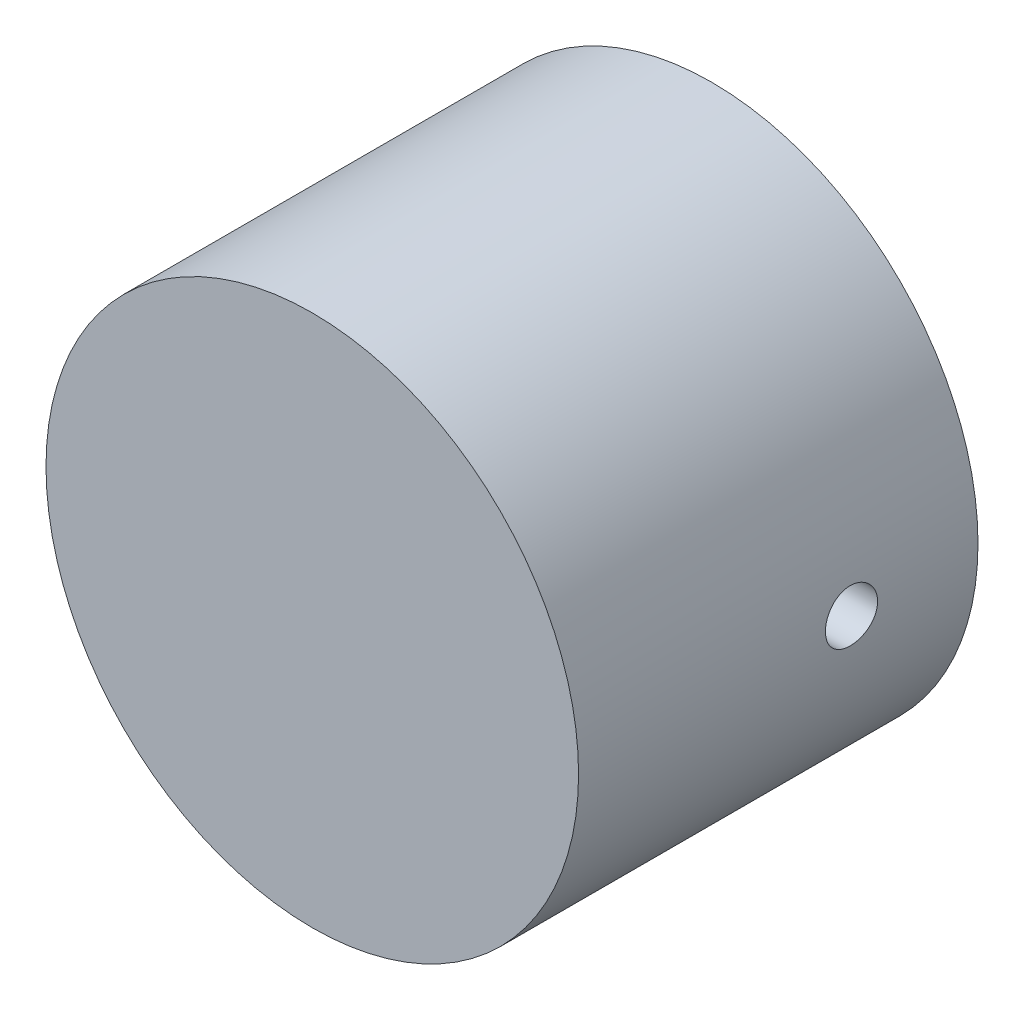
ISO-10303-21;
HEADER;
FILE_DESCRIPTION(('STEP AP214'),'2;1');
FILE_NAME('part.step','',(''),(''),'','','');
FILE_SCHEMA(('AUTOMOTIVE_DESIGN { 1 0 10303 214 1 1 1 1 }'));
ENDSEC;
DATA;
#1=APPLICATION_CONTEXT('core data for automotive mechanical design processes');
#2=APPLICATION_PROTOCOL_DEFINITION('international standard','automotive_design',2000,#1);
#3=PRODUCT_CONTEXT('',#1,'mechanical');
#4=PRODUCT('Part','Part','',(#3));
#5=PRODUCT_RELATED_PRODUCT_CATEGORY('part','',(#4));
#6=PRODUCT_DEFINITION_FORMATION('','',#4);
#7=PRODUCT_DEFINITION_CONTEXT('part definition',#1,'design');
#8=PRODUCT_DEFINITION('design','',#6,#7);
#9=PRODUCT_DEFINITION_SHAPE('','',#8);
#10=(LENGTH_UNIT() NAMED_UNIT(*) SI_UNIT(.MILLI.,.METRE.));
#11=(NAMED_UNIT(*) PLANE_ANGLE_UNIT() SI_UNIT($,.RADIAN.));
#12=(NAMED_UNIT(*) SI_UNIT($,.STERADIAN.) SOLID_ANGLE_UNIT());
#13=UNCERTAINTY_MEASURE_WITH_UNIT(LENGTH_MEASURE(1.E-05),#10,'distance_accuracy_value','');
#14=(GEOMETRIC_REPRESENTATION_CONTEXT(3) GLOBAL_UNCERTAINTY_ASSIGNED_CONTEXT((#13)) GLOBAL_UNIT_ASSIGNED_CONTEXT((#10,
#11,#12)) REPRESENTATION_CONTEXT('',''));
#15=CARTESIAN_POINT('',(0.,0.,0.));
#16=DIRECTION('',(0.,0.,1.));
#17=DIRECTION('',(1.,0.,0.));
#18=AXIS2_PLACEMENT_3D('',#15,#16,#17);
#19=CARTESIAN_POINT('',(0.,0.,-19.05));
#20=DIRECTION('',(0.,0.,1.));
#21=DIRECTION('',(1.,0.,0.));
#22=AXIS2_PLACEMENT_3D('',#19,#20,#21);
#23=CYLINDRICAL_SURFACE('',#22,9.525);
#24=CARTESIAN_POINT('',(9.525,0.,-14.2621));
#25=CARTESIAN_POINT('',(9.52499899376696,0.0695916638003268,-14.2620970601929));
#26=CARTESIAN_POINT('',(9.52422928110182,0.139226161079746,-14.2562434998505));
#27=CARTESIAN_POINT('',(9.52123279072317,0.276555629494705,-14.2329859429237));
#28=CARTESIAN_POINT('',(9.51900451327739,0.344248529369562,-14.2155700574083));
#29=CARTESIAN_POINT('',(9.51334179041614,0.475686941813274,-14.1697113018471));
#30=CARTESIAN_POINT('',(9.50990817824004,0.539435145604022,-14.1412760480047));
#31=CARTESIAN_POINT('',(9.50221614922092,0.661243227450895,-14.0742028178077));
#32=CARTESIAN_POINT('',(9.49795786816694,0.71930403961956,-14.0355665207651));
#33=CARTESIAN_POINT('',(9.48906299489322,0.828448810295295,-13.948940568395));
#34=CARTESIAN_POINT('',(9.48442449961535,0.879493758500664,-13.9009019522436));
#35=CARTESIAN_POINT('',(9.47530723310033,0.972821719092647,-13.796940196458));
#36=CARTESIAN_POINT('',(9.47082847022395,1.01510427339069,-13.7410166448644));
#37=CARTESIAN_POINT('',(9.46251911634794,1.0898539743324,-13.6226170438804));
#38=CARTESIAN_POINT('',(9.45869097942568,1.12228430647927,-13.5601175651582));
#39=CARTESIAN_POINT('',(9.4521416335894,1.17617384816128,-13.4305009525618));
#40=CARTESIAN_POINT('',(9.44942037887585,1.19763351163983,-13.3633840098789));
#41=CARTESIAN_POINT('',(9.44541121934885,1.22885342493013,-13.2268438241244));
#42=CARTESIAN_POINT('',(9.44411522118872,1.23867975946641,-13.1574359331504));
#43=CARTESIAN_POINT('',(9.44307859383045,1.24655862041931,-13.0179451025293));
#44=CARTESIAN_POINT('',(9.44333789647258,1.24461166279045,-12.9478621925986));
#45=CARTESIAN_POINT('',(9.44537516644071,1.22905340201366,-12.8094725909382));
#46=CARTESIAN_POINT('',(9.44714363385227,1.21551506272511,-12.7411575365638));
#47=CARTESIAN_POINT('',(9.45198515084481,1.17727226316354,-12.6077772674956));
#48=CARTESIAN_POINT('',(9.45505822909084,1.15256755754118,-12.5427121242443));
#49=CARTESIAN_POINT('',(9.46217342357477,1.09261541492865,-12.4174529559001));
#50=CARTESIAN_POINT('',(9.46621843127377,1.05733644081619,-12.3572741962072));
#51=CARTESIAN_POINT('',(9.47481951236272,0.977259740480976,-12.2436633856597));
#52=CARTESIAN_POINT('',(9.47937561127721,0.932461538755819,-12.1902316720448));
#53=CARTESIAN_POINT('',(9.48852769612259,0.834214484860672,-12.0912083092648));
#54=CARTESIAN_POINT('',(9.49312372313047,0.780702774528545,-12.0456790060861));
#55=CARTESIAN_POINT('',(9.50180562395982,0.666763667576891,-11.9642388871885));
#56=CARTESIAN_POINT('',(9.50589149641138,0.60633625238748,-11.928328097298));
#57=CARTESIAN_POINT('',(9.51309559696332,0.480231710960519,-11.8671436707991));
#58=CARTESIAN_POINT('',(9.51621345244018,0.414552575355872,-11.8418741290483));
#59=CARTESIAN_POINT('',(9.52112690839374,0.279833474933072,-11.8027399913867));
#60=CARTESIAN_POINT('',(9.52292257655071,0.210793682333465,-11.7888748117039));
#61=CARTESIAN_POINT('',(9.52498050315382,0.0718519177245126,-11.7730242271824));
#62=CARTESIAN_POINT('',(9.52525384230256,0.0019598970541478,-11.7709529744261));
#63=CARTESIAN_POINT('',(9.52426628233319,-0.137174619295246,-11.7785222079754));
#64=CARTESIAN_POINT('',(9.52300541899211,-0.20641713008266,-11.7881624211739));
#65=CARTESIAN_POINT('',(9.5190980152305,-0.342032355429299,-11.8188096008174));
#66=CARTESIAN_POINT('',(9.51645648894952,-0.408414519784086,-11.8397754452566));
#67=CARTESIAN_POINT('',(9.5100833731715,-0.536720854848642,-11.8924358619512));
#68=CARTESIAN_POINT('',(9.50635174356677,-0.598644861426811,-11.9241308289654));
#69=CARTESIAN_POINT('',(9.49818653724151,-0.716659246745357,-11.9975561571745));
#70=CARTESIAN_POINT('',(9.49374913973173,-0.77271494690714,-12.0393418239427));
#71=CARTESIAN_POINT('',(9.48468023359566,-0.877048225319135,-12.1316844327871));
#72=CARTESIAN_POINT('',(9.48004871652715,-0.925325464842624,-12.1822417566416));
#73=CARTESIAN_POINT('',(9.47107918081105,-1.01303764942598,-12.2910715713826));
#74=CARTESIAN_POINT('',(9.46674317355918,-1.0524155488393,-12.3493902287768));
#75=CARTESIAN_POINT('',(9.4588892277371,-1.12081665600217,-12.4718641537833));
#76=CARTESIAN_POINT('',(9.45537127150259,-1.14984008734464,-12.536019295326));
#77=CARTESIAN_POINT('',(9.44956564392585,-1.19661686004856,-12.6681639530298));
#78=CARTESIAN_POINT('',(9.44727451397199,-1.21440190993364,-12.7361420864791));
#79=CARTESIAN_POINT('',(9.44417218845417,-1.23829894822979,-12.8741519676939));
#80=CARTESIAN_POINT('',(9.44336091711561,-1.24441153431777,-12.9441836101251));
#81=CARTESIAN_POINT('',(9.4433125087689,-1.24477847665268,-13.0837448405495));
#82=CARTESIAN_POINT('',(9.44406347341831,-1.2391224651334,-13.1532742056802));
#83=CARTESIAN_POINT('',(9.44702928327325,-1.21630305124045,-13.2903847885206));
#84=CARTESIAN_POINT('',(9.44924412816889,-1.19913965130279,-13.3579660066425));
#85=CARTESIAN_POINT('',(9.45488435952931,-1.15382148820616,-13.4892473375859));
#86=CARTESIAN_POINT('',(9.45830922448267,-1.12567145967213,-13.5529491085809));
#87=CARTESIAN_POINT('',(9.46598440783224,-1.05918792362233,-13.6747394992478));
#88=CARTESIAN_POINT('',(9.47023474034486,-1.02085424195067,-13.7328280229015));
#89=CARTESIAN_POINT('',(9.47912069616025,-0.934760383588127,-13.8422006565471));
#90=CARTESIAN_POINT('',(9.48375890425771,-0.886933472709269,-13.8934320302159));
#91=CARTESIAN_POINT('',(9.49287543512057,-0.783350678833748,-13.9871755914363));
#92=CARTESIAN_POINT('',(9.49735372006256,-0.72759293545202,-14.029685727462));
#93=CARTESIAN_POINT('',(9.50566653305265,-0.609464017985763,-14.1049321997676));
#94=CARTESIAN_POINT('',(9.5094983127824,-0.547066362064877,-14.1376272485969));
#95=CARTESIAN_POINT('',(9.51605879000601,-0.417649641089422,-14.1920273420015));
#96=CARTESIAN_POINT('',(9.51878867369434,-0.350635637048566,-14.2137442110137));
#97=CARTESIAN_POINT('',(9.52218701647638,-0.236070165911652,-14.2404299807626));
#98=CARTESIAN_POINT('',(9.52323668810031,-0.189238177580591,-14.2485444054919));
#99=CARTESIAN_POINT('',(9.52464352024987,-0.0949441026959811,-14.2593803955438));
#100=CARTESIAN_POINT('',(9.52500068654744,-0.0474820213974888,-14.2621020058147));
#101=CARTESIAN_POINT('',(9.525,0.,-14.2621));
#102=B_SPLINE_CURVE_WITH_KNOTS('',3,(#24,#25,#26,#27,#28,#29,#30,#31,#32,#33,#34,#35,#36,#37,
#38,#39,#40,#41,#42,#43,#44,#45,#46,#47,#48,#49,#50,#51,#52,#53,#54,#55,#56,#57,#58,#59,#60,#61,
#62,#63,#64,#65,#66,#67,#68,#69,#70,#71,#72,#73,#74,#75,#76,#77,#78,#79,#80,#81,#82,#83,#84,#85,
#86,#87,#88,#89,#90,#91,#92,#93,#94,#95,#96,#97,#98,#99,#100,#101),.UNSPECIFIED.,.T.,.F.,(4,2,2,
2,2,2,2,2,2,2,2,2,2,2,2,2,2,2,2,2,2,2,2,2,2,2,2,2,2,2,2,2,2,2,2,2,2,2,4),(0.,0.208601540717983,
0.417417908326571,0.626090206011375,0.834728173126694,1.04448296539122,1.25424872064677,
1.46478892411098,1.67532041515466,1.88465012528203,2.09397066177948,2.30198320195953,
2.51000031284924,2.71864410216567,2.92729831606276,3.13753046934772,3.34776318715627,
3.55807673083078,3.7683795082057,3.97714951669609,4.18591465684109,4.3939268413056,
4.60194668003762,4.81113360718194,5.0203296412776,5.23083083556423,5.44132748404245,
5.65122754347253,5.86111685489043,6.0694134560209,6.27771001305703,6.48591690481895,
6.69412735746322,6.90385689112532,7.11363570374367,7.32428497519604,7.53470687337881,
7.67703577939105,7.81936349910673),.UNSPECIFIED.);
#103=CARTESIAN_POINT('',(9.525,0.,-14.2621));
#104=VERTEX_POINT('',#103);
#105=EDGE_CURVE('E40',#104,#104,#102,.T.);
#106=ORIENTED_EDGE('',*,*,#105,.T.);
#107=EDGE_LOOP('',(#106));
#108=FACE_BOUND('',#107,.T.);
#109=CARTESIAN_POINT('',(-9.525,0.,-14.2621));
#110=CARTESIAN_POINT('',(-9.52499899376696,-0.0695916638003268,-14.2620970601929));
#111=CARTESIAN_POINT('',(-9.52422928110182,-0.139226161079746,-14.2562434998505));
#112=CARTESIAN_POINT('',(-9.52123279072317,-0.276555629494705,-14.2329859429237));
#113=CARTESIAN_POINT('',(-9.51900451327739,-0.344248529369562,-14.2155700574083));
#114=CARTESIAN_POINT('',(-9.51334179041614,-0.475686941813274,-14.1697113018471));
#115=CARTESIAN_POINT('',(-9.50990817824004,-0.539435145604022,-14.1412760480047));
#116=CARTESIAN_POINT('',(-9.50221614922092,-0.661243227450895,-14.0742028178077));
#117=CARTESIAN_POINT('',(-9.49795786816693,-0.71930403961956,-14.0355665207651));
#118=CARTESIAN_POINT('',(-9.48906299489322,-0.828448810295296,-13.948940568395));
#119=CARTESIAN_POINT('',(-9.48442449961535,-0.879493758500665,-13.9009019522436));
#120=CARTESIAN_POINT('',(-9.47530723310033,-0.972821719092647,-13.796940196458));
#121=CARTESIAN_POINT('',(-9.47082847022395,-1.01510427339069,-13.7410166448644));
#122=CARTESIAN_POINT('',(-9.46251911634794,-1.0898539743324,-13.6226170438804));
#123=CARTESIAN_POINT('',(-9.45869097942568,-1.12228430647927,-13.5601175651582));
#124=CARTESIAN_POINT('',(-9.4521416335894,-1.17617384816128,-13.4305009525618));
#125=CARTESIAN_POINT('',(-9.44942037887585,-1.19763351163983,-13.3633840098789));
#126=CARTESIAN_POINT('',(-9.44541121934885,-1.22885342493013,-13.2268438241244));
#127=CARTESIAN_POINT('',(-9.44411522118872,-1.23867975946641,-13.1574359331504));
#128=CARTESIAN_POINT('',(-9.44307859383045,-1.24655862041931,-13.0179451025293));
#129=CARTESIAN_POINT('',(-9.44333789647258,-1.24461166279045,-12.9478621925986));
#130=CARTESIAN_POINT('',(-9.44537516644071,-1.22905340201366,-12.8094725909382));
#131=CARTESIAN_POINT('',(-9.44714363385226,-1.21551506272511,-12.7411575365638));
#132=CARTESIAN_POINT('',(-9.45198515084481,-1.17727226316354,-12.6077772674956));
#133=CARTESIAN_POINT('',(-9.45505822909084,-1.15256755754118,-12.5427121242443));
#134=CARTESIAN_POINT('',(-9.46217342357477,-1.09261541492865,-12.4174529559001));
#135=CARTESIAN_POINT('',(-9.46621843127377,-1.05733644081619,-12.3572741962072));
#136=CARTESIAN_POINT('',(-9.47481951236272,-0.977259740480975,-12.2436633856597));
#137=CARTESIAN_POINT('',(-9.47937561127721,-0.932461538755818,-12.1902316720448));
#138=CARTESIAN_POINT('',(-9.48852769612259,-0.834214484860672,-12.0912083092648));
#139=CARTESIAN_POINT('',(-9.49312372313047,-0.780702774528545,-12.0456790060861));
#140=CARTESIAN_POINT('',(-9.50180562395982,-0.666763667576891,-11.9642388871885));
#141=CARTESIAN_POINT('',(-9.50589149641138,-0.606336252387479,-11.928328097298));
#142=CARTESIAN_POINT('',(-9.51309559696332,-0.480231710960518,-11.8671436707991));
#143=CARTESIAN_POINT('',(-9.51621345244018,-0.414552575355872,-11.8418741290483));
#144=CARTESIAN_POINT('',(-9.52112690839374,-0.279833474933071,-11.8027399913867));
#145=CARTESIAN_POINT('',(-9.52292257655071,-0.210793682333465,-11.7888748117039));
#146=CARTESIAN_POINT('',(-9.52498050315382,-0.0718519177245123,-11.7730242271824));
#147=CARTESIAN_POINT('',(-9.52525384230256,-0.00195989705414762,-11.7709529744261));
#148=CARTESIAN_POINT('',(-9.52426628233319,0.137174619295246,-11.7785222079754));
#149=CARTESIAN_POINT('',(-9.52300541899211,0.20641713008266,-11.7881624211739));
#150=CARTESIAN_POINT('',(-9.5190980152305,0.342032355429299,-11.8188096008174));
#151=CARTESIAN_POINT('',(-9.51645648894952,0.408414519784086,-11.8397754452566));
#152=CARTESIAN_POINT('',(-9.5100833731715,0.536720854848642,-11.8924358619512));
#153=CARTESIAN_POINT('',(-9.50635174356677,0.598644861426811,-11.9241308289654));
#154=CARTESIAN_POINT('',(-9.49818653724151,0.716659246745357,-11.9975561571745));
#155=CARTESIAN_POINT('',(-9.49374913973173,0.77271494690714,-12.0393418239427));
#156=CARTESIAN_POINT('',(-9.48468023359566,0.877048225319135,-12.1316844327871));
#157=CARTESIAN_POINT('',(-9.48004871652715,0.925325464842624,-12.1822417566416));
#158=CARTESIAN_POINT('',(-9.47107918081105,1.01303764942598,-12.2910715713826));
#159=CARTESIAN_POINT('',(-9.46674317355918,1.0524155488393,-12.3493902287768));
#160=CARTESIAN_POINT('',(-9.4588892277371,1.12081665600217,-12.4718641537833));
#161=CARTESIAN_POINT('',(-9.45537127150259,1.14984008734464,-12.536019295326));
#162=CARTESIAN_POINT('',(-9.44956564392585,1.19661686004856,-12.6681639530298));
#163=CARTESIAN_POINT('',(-9.44727451397199,1.21440190993364,-12.7361420864791));
#164=CARTESIAN_POINT('',(-9.44417218845417,1.23829894822979,-12.8741519676939));
#165=CARTESIAN_POINT('',(-9.44336091711561,1.24441153431777,-12.9441836101251));
#166=CARTESIAN_POINT('',(-9.4433125087689,1.24477847665268,-13.0837448405495));
#167=CARTESIAN_POINT('',(-9.44406347341831,1.2391224651334,-13.1532742056802));
#168=CARTESIAN_POINT('',(-9.44702928327325,1.21630305124045,-13.2903847885206));
#169=CARTESIAN_POINT('',(-9.44924412816889,1.19913965130279,-13.3579660066425));
#170=CARTESIAN_POINT('',(-9.45488435952931,1.15382148820616,-13.4892473375859));
#171=CARTESIAN_POINT('',(-9.45830922448267,1.12567145967213,-13.5529491085809));
#172=CARTESIAN_POINT('',(-9.46598440783224,1.05918792362233,-13.6747394992478));
#173=CARTESIAN_POINT('',(-9.47023474034486,1.02085424195067,-13.7328280229015));
#174=CARTESIAN_POINT('',(-9.47912069616025,0.934760383588127,-13.8422006565471));
#175=CARTESIAN_POINT('',(-9.48375890425771,0.886933472709269,-13.8934320302159));
#176=CARTESIAN_POINT('',(-9.49287543512057,0.783350678833748,-13.9871755914363));
#177=CARTESIAN_POINT('',(-9.49735372006256,0.72759293545202,-14.029685727462));
#178=CARTESIAN_POINT('',(-9.50566653305265,0.609464017985763,-14.1049321997676));
#179=CARTESIAN_POINT('',(-9.5094983127824,0.547066362064878,-14.1376272485969));
#180=CARTESIAN_POINT('',(-9.51605879000601,0.417649641089423,-14.1920273420015));
#181=CARTESIAN_POINT('',(-9.51878867369434,0.350635637048566,-14.2137442110137));
#182=CARTESIAN_POINT('',(-9.52218701647638,0.236070165911652,-14.2404299807626));
#183=CARTESIAN_POINT('',(-9.52323668810031,0.189238177580591,-14.2485444054919));
#184=CARTESIAN_POINT('',(-9.52464352024987,0.0949441026959811,-14.2593803955438));
#185=CARTESIAN_POINT('',(-9.52500068654744,0.0474820213974888,-14.2621020058147));
#186=CARTESIAN_POINT('',(-9.525,0.,-14.2621));
#187=B_SPLINE_CURVE_WITH_KNOTS('',3,(#109,#110,#111,#112,#113,#114,#115,#116,#117,#118,#119,
#120,#121,#122,#123,#124,#125,#126,#127,#128,#129,#130,#131,#132,#133,#134,#135,#136,#137,#138,
#139,#140,#141,#142,#143,#144,#145,#146,#147,#148,#149,#150,#151,#152,#153,#154,#155,#156,#157,
#158,#159,#160,#161,#162,#163,#164,#165,#166,#167,#168,#169,#170,#171,#172,#173,#174,#175,#176,
#177,#178,#179,#180,#181,#182,#183,#184,#185,#186),.UNSPECIFIED.,.T.,.F.,(4,2,2,2,2,2,2,2,2,2,2,
2,2,2,2,2,2,2,2,2,2,2,2,2,2,2,2,2,2,2,2,2,2,2,2,2,2,2,4),(0.,0.208601540717983,
0.417417908326571,0.626090206011376,0.834728173126694,1.04448296539122,1.25424872064677,
1.46478892411098,1.67532041515466,1.88465012528203,2.09397066177948,2.30198320195953,
2.51000031284924,2.71864410216567,2.92729831606276,3.13753046934772,3.34776318715627,
3.55807673083078,3.7683795082057,3.97714951669609,4.18591465684109,4.3939268413056,
4.60194668003762,4.81113360718194,5.0203296412776,5.23083083556423,5.44132748404245,
5.65122754347253,5.86111685489043,6.0694134560209,6.27771001305703,6.48591690481895,
6.69412735746322,6.90385689112532,7.11363570374367,7.32428497519604,7.5347068733788,
7.67703577939105,7.81936349910673),.UNSPECIFIED.);
#188=CARTESIAN_POINT('',(-9.525,0.,-14.2621));
#189=VERTEX_POINT('',#188);
#190=EDGE_CURVE('E61',#189,#189,#187,.T.);
#191=ORIENTED_EDGE('',*,*,#190,.T.);
#192=EDGE_LOOP('',(#191));
#193=FACE_BOUND('',#192,.T.);
#194=CARTESIAN_POINT('',(0.,0.,-3.175));
#195=DIRECTION('',(0.,0.,1.));
#196=DIRECTION('',(1.,0.,0.));
#197=AXIS2_PLACEMENT_3D('',#194,#195,#196);
#198=CIRCLE('',#197,9.525);
#199=CARTESIAN_POINT('',(9.525,0.,-3.175));
#200=VERTEX_POINT('',#199);
#201=EDGE_CURVE('E99',#200,#200,#198,.T.);
#202=ORIENTED_EDGE('',*,*,#201,.T.);
#203=EDGE_LOOP('',(#202));
#204=FACE_BOUND('',#203,.T.);
#205=CARTESIAN_POINT('',(0.,0.,-15.4178));
#206=DIRECTION('',(0.,0.,-1.));
#207=DIRECTION('',(-1.,0.,0.));
#208=AXIS2_PLACEMENT_3D('',#205,#206,#207);
#209=CIRCLE('',#208,9.525);
#210=CARTESIAN_POINT('',(-9.525,0.,-15.4178));
#211=VERTEX_POINT('',#210);
#212=EDGE_CURVE('E137',#211,#211,#209,.T.);
#213=ORIENTED_EDGE('',*,*,#212,.T.);
#214=EDGE_LOOP('',(#213));
#215=FACE_BOUND('',#214,.T.);
#216=ADVANCED_FACE('F35',(#108,#193,#204,#215),#23,.F.);
#217=CARTESIAN_POINT('',(0.,0.,-19.05));
#218=DIRECTION('',(0.,0.,1.));
#219=DIRECTION('',(1.,0.,0.));
#220=AXIS2_PLACEMENT_3D('',#217,#218,#219);
#221=CYLINDRICAL_SURFACE('',#220,12.7);
#222=CARTESIAN_POINT('',(-12.7,0.,-14.2621));
#223=CARTESIAN_POINT('',(-12.6999992118775,-0.0697303020122867,-14.2620969768323));
#224=CARTESIAN_POINT('',(-12.6994196059281,-0.139506883351139,-14.2562201789768));
#225=CARTESIAN_POINT('',(-12.6971631762097,-0.277126072522789,-14.2328649127043));
#226=CARTESIAN_POINT('',(-12.6954851392076,-0.344966455229008,-14.2153736155964));
#227=CARTESIAN_POINT('',(-12.6912212943417,-0.476700422128338,-14.1693029976135));
#228=CARTESIAN_POINT('',(-12.6886360303452,-0.540596344032832,-14.1407303187638));
#229=CARTESIAN_POINT('',(-12.682846918591,-0.662671277813996,-14.0733207751815));
#230=CARTESIAN_POINT('',(-12.6796431950776,-0.72085143441189,-14.0344859714615));
#231=CARTESIAN_POINT('',(-12.6729637160054,-0.830058902227843,-13.9475101281549));
#232=CARTESIAN_POINT('',(-12.6694871535611,-0.88106364807091,-13.899340814659));
#233=CARTESIAN_POINT('',(-12.6626605116109,-0.974278550999365,-13.7951235460222));
#234=CARTESIAN_POINT('',(-12.659310437922,-1.01648830402211,-13.7390752290994));
#235=CARTESIAN_POINT('',(-12.6531077811571,-1.09099453812292,-13.6205502762126));
#236=CARTESIAN_POINT('',(-12.6502562243902,-1.12327067005917,-13.5580607902158));
#237=CARTESIAN_POINT('',(-12.6453833744956,-1.17686351932648,-13.4285165060838));
#238=CARTESIAN_POINT('',(-12.6433620616172,-1.19818049736915,-13.3614618165951));
#239=CARTESIAN_POINT('',(-12.6403857905373,-1.22918320315736,-13.2249202258657));
#240=CARTESIAN_POINT('',(-12.6394274089358,-1.23890627921643,-13.1554418806858));
#241=CARTESIAN_POINT('',(-12.6386748596695,-1.24656062005218,-13.0158333285473));
#242=CARTESIAN_POINT('',(-12.6388806625405,-1.24449218325736,-12.9457031381308));
#243=CARTESIAN_POINT('',(-12.6404301048789,-1.2286530078958,-12.80703889289));
#244=CARTESIAN_POINT('',(-12.6417697816285,-1.21492302408841,-12.7385001322796));
#245=CARTESIAN_POINT('',(-12.64542983043,-1.17621389945098,-12.6047044840328));
#246=CARTESIAN_POINT('',(-12.6477502152573,-1.15123461208068,-12.5394476391609));
#247=CARTESIAN_POINT('',(-12.6531147910418,-1.09069088173061,-12.4139393362898));
#248=CARTESIAN_POINT('',(-12.6561602183935,-1.05510833093243,-12.3536966682836));
#249=CARTESIAN_POINT('',(-12.6626306779936,-0.974381148951299,-12.240022966535));
#250=CARTESIAN_POINT('',(-12.6660557209087,-0.929236249049454,-12.1865921242845));
#251=CARTESIAN_POINT('',(-12.6729171493012,-0.830438117724241,-12.0878219367522));
#252=CARTESIAN_POINT('',(-12.6763535214325,-0.7767496848324,-12.0425177945103));
#253=CARTESIAN_POINT('',(-12.682836710536,-0.662510813140449,-11.9615597896956));
#254=CARTESIAN_POINT('',(-12.6858835270972,-0.601960367101509,-11.9259059373032));
#255=CARTESIAN_POINT('',(-12.6912452546113,-0.475692079257771,-11.865262107107));
#256=CARTESIAN_POINT('',(-12.6935600449764,-0.409973388303859,-11.840273886033));
#257=CARTESIAN_POINT('',(-12.6971956563466,-0.275245493918393,-11.8016962931197));
#258=CARTESIAN_POINT('',(-12.6985165058958,-0.206236385041385,-11.788106593937));
#259=CARTESIAN_POINT('',(-12.7000117447929,-0.06719146561197,-11.7727563982684));
#260=CARTESIAN_POINT('',(-12.7001908427011,0.00283893291063277,-11.7709473180887));
#261=CARTESIAN_POINT('',(-12.6993950179257,0.142206262335749,-11.7790821526417));
#262=CARTESIAN_POINT('',(-12.6984201102051,0.211543202218001,-11.7890259149853));
#263=CARTESIAN_POINT('',(-12.6954288556931,0.347415386450626,-11.8203438670276));
#264=CARTESIAN_POINT('',(-12.6934145790677,0.41395591671114,-11.8416953383727));
#265=CARTESIAN_POINT('',(-12.6885706006033,0.542510674534818,-11.895199289839));
#266=CARTESIAN_POINT('',(-12.6857408811698,0.604524804397516,-11.9273520030167));
#267=CARTESIAN_POINT('',(-12.6795708991914,0.7224862558398,-12.0016664356934));
#268=CARTESIAN_POINT('',(-12.6762290190811,0.778413360479164,-12.043860109678));
#269=CARTESIAN_POINT('',(-12.6694149920371,0.882408624170608,-12.1370128786762));
#270=CARTESIAN_POINT('',(-12.6659428419669,0.930476593848541,-12.1879721848462));
#271=CARTESIAN_POINT('',(-12.6592454708017,1.01755753945501,-12.2974215063956));
#272=CARTESIAN_POINT('',(-12.6560211443896,1.05653865326147,-12.3559369346195));
#273=CARTESIAN_POINT('',(-12.6501979750504,1.1241203949023,-12.4787119685481));
#274=CARTESIAN_POINT('',(-12.647599123864,1.15272115981277,-12.5429714983861));
#275=CARTESIAN_POINT('',(-12.643326665565,1.19867687163247,-12.6753009140475));
#276=CARTESIAN_POINT('',(-12.64165149359,1.21605084718545,-12.7433641389375));
#277=CARTESIAN_POINT('',(-12.6394111508632,1.2391215655445,-12.8814589921556));
#278=CARTESIAN_POINT('',(-12.6388459496491,1.24481862881635,-12.9514905664102));
#279=CARTESIAN_POINT('',(-12.6388901572597,1.24436945408861,-13.0912174977513));
#280=CARTESIAN_POINT('',(-12.6394946019183,1.23827326857305,-13.1609130227231));
#281=CARTESIAN_POINT('',(-12.6417994153479,1.21451551564151,-13.2982848320944));
#282=CARTESIAN_POINT('',(-12.6434997854153,1.19685393454406,-13.3659611141051));
#283=CARTESIAN_POINT('',(-12.6478034925059,1.15048040576535,-13.497373440787));
#284=CARTESIAN_POINT('',(-12.6504067153224,1.12176985567768,-13.5611099826164));
#285=CARTESIAN_POINT('',(-12.6562230385521,1.05411858538472,-13.6828673257106));
#286=CARTESIAN_POINT('',(-12.659436134758,1.01517793575284,-13.740888166402));
#287=CARTESIAN_POINT('',(-12.6661264925511,0.927983817209301,-13.8498236075054));
#288=CARTESIAN_POINT('',(-12.6696047765725,0.879693071052605,-13.9007083083032));
#289=CARTESIAN_POINT('',(-12.6764242512472,0.775242733802868,-13.9936744177002));
#290=CARTESIAN_POINT('',(-12.6797654088204,0.719081258260496,-14.0357537120319));
#291=CARTESIAN_POINT('',(-12.6859425507651,0.600335172368841,-14.1099942503077));
#292=CARTESIAN_POINT('',(-12.6887772870911,0.537735276637879,-14.1421311304444));
#293=CARTESIAN_POINT('',(-12.6936085059498,0.408040327631713,-14.1953946923304));
#294=CARTESIAN_POINT('',(-12.6956059355101,0.340950452885164,-14.2165338195428));
#295=CARTESIAN_POINT('',(-12.6980341823808,0.227898896669927,-14.2419161191703));
#296=CARTESIAN_POINT('',(-12.6987679370069,0.182660480748926,-14.2494747693659));
#297=CARTESIAN_POINT('',(-12.6997511038093,0.0916213695101973,-14.259567693208));
#298=CARTESIAN_POINT('',(-12.7000005178854,0.045820676398698,-14.2621019865623));
#299=CARTESIAN_POINT('',(-12.7,0.,-14.2621));
#300=B_SPLINE_CURVE_WITH_KNOTS('',3,(#222,#223,#224,#225,#226,#227,#228,#229,#230,#231,#232,
#233,#234,#235,#236,#237,#238,#239,#240,#241,#242,#243,#244,#245,#246,#247,#248,#249,#250,#251,
#252,#253,#254,#255,#256,#257,#258,#259,#260,#261,#262,#263,#264,#265,#266,#267,#268,#269,#270,
#271,#272,#273,#274,#275,#276,#277,#278,#279,#280,#281,#282,#283,#284,#285,#286,#287,#288,#289,
#290,#291,#292,#293,#294,#295,#296,#297,#298,#299),.UNSPECIFIED.,.T.,.F.,(4,2,2,2,2,2,2,2,2,2,2,
2,2,2,2,2,2,2,2,2,2,2,2,2,2,2,2,2,2,2,2,2,2,2,2,2,2,2,4),(0.,0.209023589231034,
0.418278438489406,0.627408056675216,0.836495705811906,1.04622686307429,1.25596765375546,
1.46613528427644,1.6762979148057,1.88578168761911,2.0952601586828,2.30400954276648,
2.51276164622489,2.72187231119901,2.93098885333196,3.14099044735331,3.35099226291022,
3.56102865440525,3.77105901385791,3.98022264907491,4.1893835722733,4.39812949750455,
4.60687992709801,4.81630378657599,5.02573269159929,5.23588524778483,5.4460350287325,
5.65582767928566,5.8656145721293,6.07451304805127,6.28341177109341,6.49228407903672,
6.70115494609034,6.91087636148271,7.1206480754811,7.33092983462728,7.54097311071026,
7.67832573264912,7.81567781582469),.UNSPECIFIED.);
#301=CARTESIAN_POINT('',(-12.7,0.,-14.2621));
#302=VERTEX_POINT('',#301);
#303=EDGE_CURVE('E91',#302,#302,#300,.T.);
#304=ORIENTED_EDGE('',*,*,#303,.F.);
#305=EDGE_LOOP('',(#304));
#306=FACE_BOUND('',#305,.T.);
#307=CARTESIAN_POINT('',(12.7,0.,-14.2621));
#308=CARTESIAN_POINT('',(12.6999992118775,0.0697303020122868,-14.2620969768323));
#309=CARTESIAN_POINT('',(12.6994196059281,0.139506883351139,-14.2562201789768));
#310=CARTESIAN_POINT('',(12.6971631762097,0.277126072522789,-14.2328649127043));
#311=CARTESIAN_POINT('',(12.6954851392076,0.344966455229008,-14.2153736155964));
#312=CARTESIAN_POINT('',(12.6912212943417,0.476700422128338,-14.1693029976135));
#313=CARTESIAN_POINT('',(12.6886360303452,0.540596344032832,-14.1407303187638));
#314=CARTESIAN_POINT('',(12.682846918591,0.662671277813997,-14.0733207751815));
#315=CARTESIAN_POINT('',(12.6796431950776,0.720851434411891,-14.0344859714615));
#316=CARTESIAN_POINT('',(12.6729637160054,0.830058902227843,-13.9475101281549));
#317=CARTESIAN_POINT('',(12.6694871535611,0.88106364807091,-13.899340814659));
#318=CARTESIAN_POINT('',(12.6626605116109,0.974278550999365,-13.7951235460222));
#319=CARTESIAN_POINT('',(12.659310437922,1.01648830402211,-13.7390752290994));
#320=CARTESIAN_POINT('',(12.6531077811571,1.09099453812292,-13.6205502762126));
#321=CARTESIAN_POINT('',(12.6502562243902,1.12327067005917,-13.5580607902158));
#322=CARTESIAN_POINT('',(12.6453833744956,1.17686351932648,-13.4285165060838));
#323=CARTESIAN_POINT('',(12.6433620616172,1.19818049736915,-13.3614618165951));
#324=CARTESIAN_POINT('',(12.6403857905373,1.22918320315736,-13.2249202258657));
#325=CARTESIAN_POINT('',(12.6394274089358,1.23890627921643,-13.1554418806858));
#326=CARTESIAN_POINT('',(12.6386748596695,1.24656062005218,-13.0158333285473));
#327=CARTESIAN_POINT('',(12.6388806625405,1.24449218325736,-12.9457031381308));
#328=CARTESIAN_POINT('',(12.6404301048789,1.2286530078958,-12.80703889289));
#329=CARTESIAN_POINT('',(12.6417697816285,1.21492302408841,-12.7385001322796));
#330=CARTESIAN_POINT('',(12.64542983043,1.17621389945098,-12.6047044840328));
#331=CARTESIAN_POINT('',(12.6477502152573,1.15123461208068,-12.5394476391609));
#332=CARTESIAN_POINT('',(12.6531147910418,1.09069088173061,-12.4139393362898));
#333=CARTESIAN_POINT('',(12.6561602183935,1.05510833093243,-12.3536966682836));
#334=CARTESIAN_POINT('',(12.6626306779936,0.974381148951299,-12.240022966535));
#335=CARTESIAN_POINT('',(12.6660557209087,0.929236249049454,-12.1865921242845));
#336=CARTESIAN_POINT('',(12.6729171493012,0.830438117724241,-12.0878219367522));
#337=CARTESIAN_POINT('',(12.6763535214325,0.7767496848324,-12.0425177945103));
#338=CARTESIAN_POINT('',(12.682836710536,0.662510813140448,-11.9615597896956));
#339=CARTESIAN_POINT('',(12.6858835270972,0.601960367101509,-11.9259059373032));
#340=CARTESIAN_POINT('',(12.6912452546113,0.47569207925777,-11.865262107107));
#341=CARTESIAN_POINT('',(12.6935600449764,0.409973388303858,-11.840273886033));
#342=CARTESIAN_POINT('',(12.6971956563466,0.275245493918392,-11.8016962931197));
#343=CARTESIAN_POINT('',(12.6985165058958,0.206236385041384,-11.788106593937));
#344=CARTESIAN_POINT('',(12.7000117447929,0.0671914656119696,-11.7727563982684));
#345=CARTESIAN_POINT('',(12.7001908427011,-0.00283893291063317,-11.7709473180887));
#346=CARTESIAN_POINT('',(12.6993950179257,-0.14220626233575,-11.7790821526417));
#347=CARTESIAN_POINT('',(12.6984201102051,-0.211543202218001,-11.7890259149853));
#348=CARTESIAN_POINT('',(12.6954288556931,-0.347415386450626,-11.8203438670276));
#349=CARTESIAN_POINT('',(12.6934145790677,-0.413955916711141,-11.8416953383727));
#350=CARTESIAN_POINT('',(12.6885706006033,-0.542510674534819,-11.895199289839));
#351=CARTESIAN_POINT('',(12.6857408811698,-0.604524804397516,-11.9273520030167));
#352=CARTESIAN_POINT('',(12.6795708991914,-0.7224862558398,-12.0016664356934));
#353=CARTESIAN_POINT('',(12.6762290190811,-0.778413360479164,-12.043860109678));
#354=CARTESIAN_POINT('',(12.6694149920371,-0.882408624170608,-12.1370128786762));
#355=CARTESIAN_POINT('',(12.6659428419669,-0.930476593848541,-12.1879721848462));
#356=CARTESIAN_POINT('',(12.6592454708017,-1.01755753945501,-12.2974215063956));
#357=CARTESIAN_POINT('',(12.6560211443896,-1.05653865326147,-12.3559369346195));
#358=CARTESIAN_POINT('',(12.6501979750504,-1.1241203949023,-12.4787119685481));
#359=CARTESIAN_POINT('',(12.647599123864,-1.15272115981277,-12.5429714983861));
#360=CARTESIAN_POINT('',(12.643326665565,-1.19867687163247,-12.6753009140475));
#361=CARTESIAN_POINT('',(12.64165149359,-1.21605084718545,-12.7433641389375));
#362=CARTESIAN_POINT('',(12.6394111508632,-1.2391215655445,-12.8814589921556));
#363=CARTESIAN_POINT('',(12.6388459496491,-1.24481862881635,-12.9514905664102));
#364=CARTESIAN_POINT('',(12.6388901572597,-1.24436945408861,-13.0912174977513));
#365=CARTESIAN_POINT('',(12.6394946019183,-1.23827326857305,-13.1609130227231));
#366=CARTESIAN_POINT('',(12.6417994153479,-1.21451551564151,-13.2982848320944));
#367=CARTESIAN_POINT('',(12.6434997854153,-1.19685393454406,-13.3659611141051));
#368=CARTESIAN_POINT('',(12.6478034925059,-1.15048040576535,-13.497373440787));
#369=CARTESIAN_POINT('',(12.6504067153224,-1.12176985567768,-13.5611099826164));
#370=CARTESIAN_POINT('',(12.6562230385521,-1.05411858538472,-13.6828673257106));
#371=CARTESIAN_POINT('',(12.659436134758,-1.01517793575284,-13.740888166402));
#372=CARTESIAN_POINT('',(12.6661264925511,-0.927983817209301,-13.8498236075054));
#373=CARTESIAN_POINT('',(12.6696047765725,-0.879693071052605,-13.9007083083032));
#374=CARTESIAN_POINT('',(12.6764242512472,-0.775242733802869,-13.9936744177002));
#375=CARTESIAN_POINT('',(12.6797654088204,-0.719081258260496,-14.0357537120319));
#376=CARTESIAN_POINT('',(12.6859425507651,-0.600335172368841,-14.1099942503077));
#377=CARTESIAN_POINT('',(12.6887772870911,-0.537735276637879,-14.1421311304444));
#378=CARTESIAN_POINT('',(12.6936085059498,-0.408040327631713,-14.1953946923304));
#379=CARTESIAN_POINT('',(12.6956059355101,-0.340950452885164,-14.2165338195428));
#380=CARTESIAN_POINT('',(12.6980341823808,-0.227898896669927,-14.2419161191703));
#381=CARTESIAN_POINT('',(12.6987679370069,-0.182660480748925,-14.2494747693659));
#382=CARTESIAN_POINT('',(12.6997511038093,-0.0916213695101968,-14.259567693208));
#383=CARTESIAN_POINT('',(12.7000005178854,-0.0458206763986977,-14.2621019865623));
#384=CARTESIAN_POINT('',(12.7,0.,-14.2621));
#385=B_SPLINE_CURVE_WITH_KNOTS('',3,(#307,#308,#309,#310,#311,#312,#313,#314,#315,#316,#317,
#318,#319,#320,#321,#322,#323,#324,#325,#326,#327,#328,#329,#330,#331,#332,#333,#334,#335,#336,
#337,#338,#339,#340,#341,#342,#343,#344,#345,#346,#347,#348,#349,#350,#351,#352,#353,#354,#355,
#356,#357,#358,#359,#360,#361,#362,#363,#364,#365,#366,#367,#368,#369,#370,#371,#372,#373,#374,
#375,#376,#377,#378,#379,#380,#381,#382,#383,#384),.UNSPECIFIED.,.T.,.F.,(4,2,2,2,2,2,2,2,2,2,2,
2,2,2,2,2,2,2,2,2,2,2,2,2,2,2,2,2,2,2,2,2,2,2,2,2,2,2,4),(0.,0.209023589231034,
0.418278438489406,0.627408056675217,0.836495705811907,1.04622686307429,1.25596765375546,
1.46613528427644,1.6762979148057,1.88578168761911,2.0952601586828,2.30400954276648,
2.51276164622489,2.72187231119901,2.93098885333196,3.14099044735331,3.35099226291022,
3.56102865440525,3.77105901385791,3.98022264907491,4.1893835722733,4.39812949750455,
4.60687992709801,4.81630378657599,5.02573269159929,5.23588524778483,5.4460350287325,
5.65582767928566,5.8656145721293,6.07451304805127,6.28341177109341,6.49228407903672,
6.70115494609034,6.91087636148271,7.1206480754811,7.33092983462728,7.54097311071026,
7.67832573264912,7.81567781582469),.UNSPECIFIED.);
#386=CARTESIAN_POINT('',(12.7,0.,-14.2621));
#387=VERTEX_POINT('',#386);
#388=EDGE_CURVE('E84',#387,#387,#385,.T.);
#389=ORIENTED_EDGE('',*,*,#388,.F.);
#390=EDGE_LOOP('',(#389));
#391=FACE_BOUND('',#390,.T.);
#392=CARTESIAN_POINT('',(0.,0.,-19.05));
#393=DIRECTION('',(0.,0.,1.));
#394=DIRECTION('',(1.,0.,0.));
#395=AXIS2_PLACEMENT_3D('',#392,#393,#394);
#396=CIRCLE('',#395,12.7);
#397=CARTESIAN_POINT('',(12.7,0.,-19.05));
#398=VERTEX_POINT('',#397);
#399=EDGE_CURVE('E10',#398,#398,#396,.T.);
#400=ORIENTED_EDGE('',*,*,#399,.T.);
#401=EDGE_LOOP('',(#400));
#402=FACE_BOUND('',#401,.T.);
#403=CARTESIAN_POINT('',(0.,0.,0.));
#404=DIRECTION('',(0.,0.,1.));
#405=DIRECTION('',(1.,0.,0.));
#406=AXIS2_PLACEMENT_3D('',#403,#404,#405);
#407=CIRCLE('',#406,12.7);
#408=CARTESIAN_POINT('',(12.7,0.,0.));
#409=VERTEX_POINT('',#408);
#410=EDGE_CURVE('E50',#409,#409,#407,.T.);
#411=ORIENTED_EDGE('',*,*,#410,.F.);
#412=EDGE_LOOP('',(#411));
#413=FACE_BOUND('',#412,.T.);
#414=ADVANCED_FACE('F37',(#306,#391,#402,#413),#221,.T.);
#415=CARTESIAN_POINT('',(0.,0.,-19.05));
#416=DIRECTION('',(0.,0.,1.));
#417=DIRECTION('',(1.,0.,0.));
#418=AXIS2_PLACEMENT_3D('',#415,#416,#417);
#419=PLANE('',#418);
#420=CARTESIAN_POINT('',(0.,0.,-19.05));
#421=DIRECTION('',(0.,0.,1.));
#422=DIRECTION('',(1.,0.,0.));
#423=AXIS2_PLACEMENT_3D('',#420,#421,#422);
#424=CIRCLE('',#423,9.525);
#425=CARTESIAN_POINT('',(9.525,0.,-19.05));
#426=VERTEX_POINT('',#425);
#427=EDGE_CURVE('E57',#426,#426,#424,.T.);
#428=ORIENTED_EDGE('',*,*,#427,.T.);
#429=EDGE_LOOP('',(#428));
#430=FACE_BOUND('',#429,.T.);
#431=ORIENTED_EDGE('',*,*,#399,.F.);
#432=EDGE_LOOP('',(#431));
#433=FACE_BOUND('',#432,.T.);
#434=ADVANCED_FACE('F110',(#430,#433),#419,.F.);
#435=CARTESIAN_POINT('',(0.,0.,0.));
#436=DIRECTION('',(0.,0.,1.));
#437=DIRECTION('',(1.,0.,0.));
#438=AXIS2_PLACEMENT_3D('',#435,#436,#437);
#439=PLANE('',#438);
#440=ORIENTED_EDGE('',*,*,#410,.T.);
#441=EDGE_LOOP('',(#440));
#442=FACE_BOUND('',#441,.T.);
#443=ADVANCED_FACE('F115',(#442),#439,.T.);
#444=CARTESIAN_POINT('',(0.,0.,-17.78));
#445=DIRECTION('',(0.,0.,-1.));
#446=DIRECTION('',(-1.,0.,0.));
#447=AXIS2_PLACEMENT_3D('',#444,#445,#446);
#448=CIRCLE('',#447,9.525);
#449=CARTESIAN_POINT('',(9.525,0.,-17.78));
#450=VERTEX_POINT('',#449);
#451=EDGE_CURVE('E140',#450,#450,#448,.T.);
#452=CARTESIAN_POINT('',(9.525,0.,-17.78));
#453=CARTESIAN_POINT('',(9.525,0.,-17.7932291666667));
#454=CARTESIAN_POINT('',(9.525,0.,-17.8064583333333));
#455=CARTESIAN_POINT('',(9.525,0.,-17.8329166666667));
#456=CARTESIAN_POINT('',(9.525,0.,-17.8461458333333));
#457=CARTESIAN_POINT('',(9.525,0.,-17.8726041666667));
#458=CARTESIAN_POINT('',(9.525,0.,-17.8858333333333));
#459=CARTESIAN_POINT('',(9.525,0.,-17.9122916666667));
#460=CARTESIAN_POINT('',(9.525,0.,-17.9255208333333));
#461=CARTESIAN_POINT('',(9.525,0.,-17.9519791666667));
#462=CARTESIAN_POINT('',(9.525,0.,-17.9652083333333));
#463=CARTESIAN_POINT('',(9.525,0.,-17.9916666666667));
#464=CARTESIAN_POINT('',(9.525,0.,-18.0048958333333));
#465=CARTESIAN_POINT('',(9.525,0.,-18.0313541666667));
#466=CARTESIAN_POINT('',(9.525,0.,-18.0445833333333));
#467=CARTESIAN_POINT('',(9.525,0.,-18.0710416666667));
#468=CARTESIAN_POINT('',(9.525,0.,-18.0842708333333));
#469=CARTESIAN_POINT('',(9.525,0.,-18.1107291666667));
#470=CARTESIAN_POINT('',(9.525,0.,-18.1239583333333));
#471=CARTESIAN_POINT('',(9.525,0.,-18.1504166666667));
#472=CARTESIAN_POINT('',(9.525,0.,-18.1636458333333));
#473=CARTESIAN_POINT('',(9.525,0.,-18.1901041666667));
#474=CARTESIAN_POINT('',(9.525,0.,-18.2033333333333));
#475=CARTESIAN_POINT('',(9.525,0.,-18.2297916666667));
#476=CARTESIAN_POINT('',(9.525,0.,-18.2430208333333));
#477=CARTESIAN_POINT('',(9.525,0.,-18.2694791666667));
#478=CARTESIAN_POINT('',(9.525,0.,-18.2827083333333));
#479=CARTESIAN_POINT('',(9.525,0.,-18.3091666666667));
#480=CARTESIAN_POINT('',(9.525,0.,-18.3223958333333));
#481=CARTESIAN_POINT('',(9.525,0.,-18.3488541666667));
#482=CARTESIAN_POINT('',(9.525,0.,-18.3620833333333));
#483=CARTESIAN_POINT('',(9.525,0.,-18.3885416666667));
#484=CARTESIAN_POINT('',(9.525,0.,-18.4017708333333));
#485=CARTESIAN_POINT('',(9.525,0.,-18.4282291666667));
#486=CARTESIAN_POINT('',(9.525,0.,-18.4414583333333));
#487=CARTESIAN_POINT('',(9.525,0.,-18.4679166666667));
#488=CARTESIAN_POINT('',(9.525,0.,-18.4811458333333));
#489=CARTESIAN_POINT('',(9.525,0.,-18.5076041666667));
#490=CARTESIAN_POINT('',(9.525,0.,-18.5208333333333));
#491=CARTESIAN_POINT('',(9.525,0.,-18.5472916666667));
#492=CARTESIAN_POINT('',(9.525,0.,-18.5605208333333));
#493=CARTESIAN_POINT('',(9.525,0.,-18.5869791666667));
#494=CARTESIAN_POINT('',(9.525,0.,-18.6002083333333));
#495=CARTESIAN_POINT('',(9.525,0.,-18.6266666666667));
#496=CARTESIAN_POINT('',(9.525,0.,-18.6398958333333));
#497=CARTESIAN_POINT('',(9.525,0.,-18.6663541666667));
#498=CARTESIAN_POINT('',(9.525,0.,-18.6795833333333));
#499=CARTESIAN_POINT('',(9.525,0.,-18.7060416666667));
#500=CARTESIAN_POINT('',(9.525,0.,-18.7192708333333));
#501=CARTESIAN_POINT('',(9.525,0.,-18.7457291666667));
#502=CARTESIAN_POINT('',(9.525,0.,-18.7589583333333));
#503=CARTESIAN_POINT('',(9.525,0.,-18.7854166666667));
#504=CARTESIAN_POINT('',(9.525,0.,-18.7986458333333));
#505=CARTESIAN_POINT('',(9.525,0.,-18.8251041666667));
#506=CARTESIAN_POINT('',(9.525,0.,-18.8383333333333));
#507=CARTESIAN_POINT('',(9.525,0.,-18.8647916666667));
#508=CARTESIAN_POINT('',(9.525,0.,-18.8780208333333));
#509=CARTESIAN_POINT('',(9.525,0.,-18.9044791666667));
#510=CARTESIAN_POINT('',(9.525,0.,-18.9177083333333));
#511=CARTESIAN_POINT('',(9.525,0.,-18.9441666666667));
#512=CARTESIAN_POINT('',(9.525,0.,-18.9573958333333));
#513=CARTESIAN_POINT('',(9.525,0.,-18.9838541666667));
#514=CARTESIAN_POINT('',(9.525,0.,-18.9970833333333));
#515=CARTESIAN_POINT('',(9.525,0.,-19.0235416666667));
#516=CARTESIAN_POINT('',(9.525,0.,-19.0367708333333));
#517=CARTESIAN_POINT('',(9.525,0.,-19.05));
#518=B_SPLINE_CURVE_WITH_KNOTS('',3,(#452,#453,#454,#455,#456,#457,#458,#459,#460,#461,#462,
#463,#464,#465,#466,#467,#468,#469,#470,#471,#472,#473,#474,#475,#476,#477,#478,#479,#480,#481,
#482,#483,#484,#485,#486,#487,#488,#489,#490,#491,#492,#493,#494,#495,#496,#497,#498,#499,#500,
#501,#502,#503,#504,#505,#506,#507,#508,#509,#510,#511,#512,#513,#514,#515,#516,#517),
.UNSPECIFIED.,.F.,.F.,(4,2,2,2,2,2,2,2,2,2,2,2,2,2,2,2,2,2,2,2,2,2,2,2,2,2,2,2,2,2,2,2,4),(0.,
0.0396874999999998,0.0793749999999996,0.119062499999999,0.158749999999999,0.198437499999999,
0.238124999999999,0.277812499999999,0.317499999999998,0.357187499999998,0.396874999999998,
0.436562500000001,0.476250000000001,0.515937500000001,0.555625000000001,0.5953125,0.635,
0.6746875,0.714375,0.7540625,0.793749999999999,0.833437499999999,0.873125000000002,
0.912812500000002,0.952500000000002,0.992187500000002,1.031875,1.0715625,1.11125,1.1509375,
1.190625,1.2303125,1.27),.UNSPECIFIED.);
#519=EDGE_CURVE('BSEAM68',#450,#426,#518,.T.);
#520=ORIENTED_EDGE('',*,*,#451,.F.);
#521=ORIENTED_EDGE('',*,*,#427,.F.);
#522=ORIENTED_EDGE('',*,*,#519,.T.);
#523=ORIENTED_EDGE('',*,*,#519,.F.);
#524=EDGE_LOOP('',(#520,#522,#521,#523));
#525=FACE_BOUND('',#524,.T.);
#526=ADVANCED_FACE('F68',(#525),#23,.F.);
#527=CARTESIAN_POINT('',(0.,0.,-3.175));
#528=DIRECTION('',(0.,0.,1.));
#529=DIRECTION('',(1.,0.,0.));
#530=AXIS2_PLACEMENT_3D('',#527,#528,#529);
#531=PLANE('',#530);
#532=ORIENTED_EDGE('',*,*,#201,.F.);
#533=EDGE_LOOP('',(#532));
#534=FACE_BOUND('',#533,.T.);
#535=ADVANCED_FACE('F114',(#534),#531,.F.);
#536=CARTESIAN_POINT('',(-12.7,0.,-13.0175));
#537=DIRECTION('',(1.,0.,0.));
#538=DIRECTION('',(0.,0.,-1.));
#539=AXIS2_PLACEMENT_3D('',#536,#537,#538);
#540=CYLINDRICAL_SURFACE('',#539,1.2446);
#541=ORIENTED_EDGE('',*,*,#303,.T.);
#542=EDGE_LOOP('',(#541));
#543=FACE_BOUND('',#542,.T.);
#544=ORIENTED_EDGE('',*,*,#190,.F.);
#545=EDGE_LOOP('',(#544));
#546=FACE_BOUND('',#545,.T.);
#547=ADVANCED_FACE('F76',(#543,#546),#540,.F.);
#548=ORIENTED_EDGE('',*,*,#388,.T.);
#549=EDGE_LOOP('',(#548));
#550=FACE_BOUND('',#549,.T.);
#551=ORIENTED_EDGE('',*,*,#105,.F.);
#552=EDGE_LOOP('',(#551));
#553=FACE_BOUND('',#552,.T.);
#554=ADVANCED_FACE('F71',(#550,#553),#540,.F.);
#555=CARTESIAN_POINT('',(0.,0.,-15.4178));
#556=DIRECTION('',(0.,0.,-1.));
#557=DIRECTION('',(-1.,0.,0.));
#558=AXIS2_PLACEMENT_3D('',#555,#556,#557);
#559=CYLINDRICAL_SURFACE('',#558,10.8712);
#560=CARTESIAN_POINT('',(0.,0.,-15.4178));
#561=DIRECTION('',(0.,0.,-1.));
#562=DIRECTION('',(-1.,0.,0.));
#563=AXIS2_PLACEMENT_3D('',#560,#561,#562);
#564=CIRCLE('',#563,10.8712);
#565=CARTESIAN_POINT('',(-10.8712,0.,-15.4178));
#566=VERTEX_POINT('',#565);
#567=EDGE_CURVE('E67',#566,#566,#564,.T.);
#568=ORIENTED_EDGE('',*,*,#567,.F.);
#569=EDGE_LOOP('',(#568));
#570=FACE_BOUND('',#569,.T.);
#571=CARTESIAN_POINT('',(0.,0.,-17.78));
#572=DIRECTION('',(0.,0.,-1.));
#573=DIRECTION('',(-1.,0.,0.));
#574=AXIS2_PLACEMENT_3D('',#571,#572,#573);
#575=CIRCLE('',#574,10.8712);
#576=CARTESIAN_POINT('',(-10.8712,0.,-17.78));
#577=VERTEX_POINT('',#576);
#578=EDGE_CURVE('E92',#577,#577,#575,.T.);
#579=ORIENTED_EDGE('',*,*,#578,.T.);
#580=EDGE_LOOP('',(#579));
#581=FACE_BOUND('',#580,.T.);
#582=ADVANCED_FACE('F75',(#570,#581),#559,.F.);
#583=CARTESIAN_POINT('',(0.,0.,-15.4178));
#584=DIRECTION('',(0.,0.,-1.));
#585=DIRECTION('',(-1.,0.,0.));
#586=AXIS2_PLACEMENT_3D('',#583,#584,#585);
#587=PLANE('',#586);
#588=ORIENTED_EDGE('',*,*,#212,.F.);
#589=EDGE_LOOP('',(#588));
#590=FACE_BOUND('',#589,.T.);
#591=ORIENTED_EDGE('',*,*,#567,.T.);
#592=EDGE_LOOP('',(#591));
#593=FACE_BOUND('',#592,.T.);
#594=ADVANCED_FACE('F149',(#590,#593),#587,.T.);
#595=CARTESIAN_POINT('',(0.,0.,-17.78));
#596=DIRECTION('',(0.,0.,-1.));
#597=DIRECTION('',(-1.,0.,0.));
#598=AXIS2_PLACEMENT_3D('',#595,#596,#597);
#599=PLANE('',#598);
#600=ORIENTED_EDGE('',*,*,#451,.T.);
#601=EDGE_LOOP('',(#600));
#602=FACE_BOUND('',#601,.T.);
#603=ORIENTED_EDGE('',*,*,#578,.F.);
#604=EDGE_LOOP('',(#603));
#605=FACE_BOUND('',#604,.T.);
#606=ADVANCED_FACE('F155',(#602,#605),#599,.F.);
#607=CLOSED_SHELL('',(#216,#414,#434,#443,#526,#535,#547,#554,#582,#594,#606));
#608=MANIFOLD_SOLID_BREP('B2',#607);
#609=ADVANCED_BREP_SHAPE_REPRESENTATION('',(#18,#608),#14);
#610=SHAPE_DEFINITION_REPRESENTATION(#9,#609);
ENDSEC;
END-ISO-10303-21;
